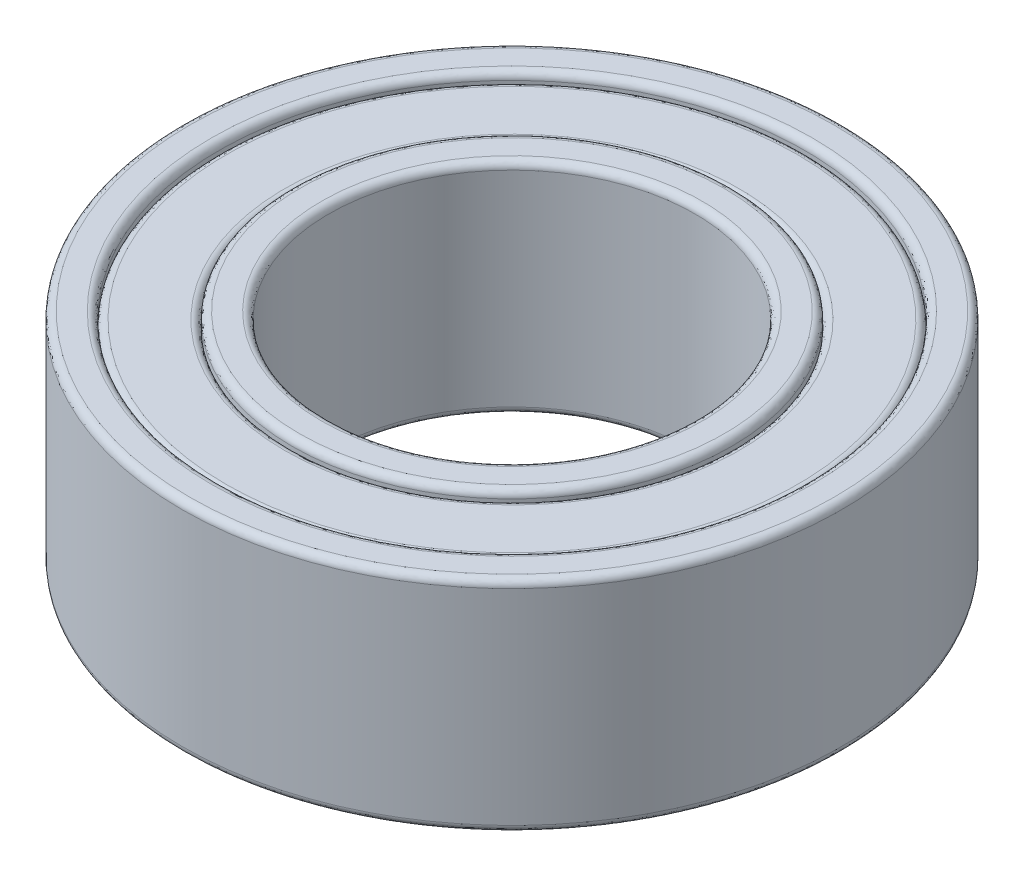
ISO-10303-21;
HEADER;
FILE_DESCRIPTION(('STEP AP214'),'2;1');
FILE_NAME('part.step','',(''),(''),'','','');
FILE_SCHEMA(('AUTOMOTIVE_DESIGN { 1 0 10303 214 1 1 1 1 }'));
ENDSEC;
DATA;
#1=APPLICATION_CONTEXT('core data for automotive mechanical design processes');
#2=APPLICATION_PROTOCOL_DEFINITION('international standard','automotive_design',2000,#1);
#3=PRODUCT_CONTEXT('',#1,'mechanical');
#4=PRODUCT('Part','Part','',(#3));
#5=PRODUCT_RELATED_PRODUCT_CATEGORY('part','',(#4));
#6=PRODUCT_DEFINITION_FORMATION('','',#4);
#7=PRODUCT_DEFINITION_CONTEXT('part definition',#1,'design');
#8=PRODUCT_DEFINITION('design','',#6,#7);
#9=PRODUCT_DEFINITION_SHAPE('','',#8);
#10=(LENGTH_UNIT() NAMED_UNIT(*) SI_UNIT(.MILLI.,.METRE.));
#11=(NAMED_UNIT(*) PLANE_ANGLE_UNIT() SI_UNIT($,.RADIAN.));
#12=(NAMED_UNIT(*) SI_UNIT($,.STERADIAN.) SOLID_ANGLE_UNIT());
#13=UNCERTAINTY_MEASURE_WITH_UNIT(LENGTH_MEASURE(1.E-05),#10,'distance_accuracy_value','');
#14=(GEOMETRIC_REPRESENTATION_CONTEXT(3) GLOBAL_UNCERTAINTY_ASSIGNED_CONTEXT((#13)) GLOBAL_UNIT_ASSIGNED_CONTEXT((#10,
#11,#12)) REPRESENTATION_CONTEXT('',''));
#15=CARTESIAN_POINT('',(0.,0.,0.));
#16=DIRECTION('',(0.,0.,1.));
#17=DIRECTION('',(1.,0.,0.));
#18=AXIS2_PLACEMENT_3D('',#15,#16,#17);
#19=CARTESIAN_POINT('',(0.,2.9,0.));
#20=DIRECTION('',(0.,-1.,0.));
#21=DIRECTION('',(0.,0.,1.));
#22=AXIS2_PLACEMENT_3D('',#19,#20,#21);
#23=CYLINDRICAL_SURFACE('',#22,3.);
#24=DIRECTION('',(0.,-1.,0.));
#25=VECTOR('',#24,1.);
#26=CARTESIAN_POINT('',(0.,2.9,3.));
#27=LINE('',#26,#25);
#28=CARTESIAN_POINT('',(0.,2.9,3.));
#29=VERTEX_POINT('',#28);
#30=CARTESIAN_POINT('',(0.,2.8,3.));
#31=VERTEX_POINT('',#30);
#32=EDGE_CURVE('E11',#29,#31,#27,.T.);
#33=ORIENTED_EDGE('',*,*,#32,.T.);
#34=CARTESIAN_POINT('',(0.,2.8,0.));
#35=DIRECTION('',(0.,1.,0.));
#36=DIRECTION('',(0.,0.,1.));
#37=AXIS2_PLACEMENT_3D('',#34,#35,#36);
#38=CIRCLE('',#37,3.);
#39=EDGE_CURVE('E28',#31,#31,#38,.T.);
#40=ORIENTED_EDGE('',*,*,#39,.T.);
#41=ORIENTED_EDGE('',*,*,#32,.F.);
#42=CARTESIAN_POINT('',(0.,2.9,0.));
#43=DIRECTION('',(0.,1.,0.));
#44=DIRECTION('',(0.,0.,1.));
#45=AXIS2_PLACEMENT_3D('',#42,#43,#44);
#46=CIRCLE('',#45,3.);
#47=EDGE_CURVE('E145',#29,#29,#46,.T.);
#48=ORIENTED_EDGE('',*,*,#47,.F.);
#49=EDGE_LOOP('',(#33,#40,#41,#48));
#50=FACE_BOUND('',#49,.T.);
#51=ADVANCED_FACE('F16',(#50),#23,.T.);
#52=CARTESIAN_POINT('',(0.,2.8,3.));
#53=CARTESIAN_POINT('',(0.,2.85857864376269,3.));
#54=CARTESIAN_POINT('',(0.,2.9,3.04142135623731));
#55=CARTESIAN_POINT('',(0.,2.9,3.1));
#56=(BOUNDED_CURVE() B_SPLINE_CURVE(3,(#52,#53,#54,#55),.UNSPECIFIED.,.F.,
.F.) B_SPLINE_CURVE_WITH_KNOTS((4,4),(0.,1.),
.UNSPECIFIED.) CURVE() GEOMETRIC_REPRESENTATION_ITEM() RATIONAL_B_SPLINE_CURVE((1.,
0.804737854124365,0.804737854124365,1.)) REPRESENTATION_ITEM(''));
#57=CARTESIAN_POINT('',(0.,0.,0.));
#58=DIRECTION('',(0.,-1.,0.));
#59=AXIS1_PLACEMENT('',#57,#58);
#60=SURFACE_OF_REVOLUTION('',#56,#59);
#61=CARTESIAN_POINT('',(0.,2.8,3.1));
#62=DIRECTION('',(1.,0.,0.));
#63=DIRECTION('',(0.,1.,0.));
#64=AXIS2_PLACEMENT_3D('',#61,#62,#63);
#65=CIRCLE('',#64,0.1);
#66=CARTESIAN_POINT('',(0.,2.9,3.1));
#67=VERTEX_POINT('',#66);
#68=EDGE_CURVE('E48',#31,#67,#65,.T.);
#69=ORIENTED_EDGE('',*,*,#68,.T.);
#70=CARTESIAN_POINT('',(0.,2.9,0.));
#71=DIRECTION('',(0.,1.,0.));
#72=DIRECTION('',(0.,0.,1.));
#73=AXIS2_PLACEMENT_3D('',#70,#71,#72);
#74=CIRCLE('',#73,3.1);
#75=EDGE_CURVE('E161',#67,#67,#74,.T.);
#76=ORIENTED_EDGE('',*,*,#75,.T.);
#77=ORIENTED_EDGE('',*,*,#68,.F.);
#78=ORIENTED_EDGE('',*,*,#39,.F.);
#79=EDGE_LOOP('',(#69,#76,#77,#78));
#80=FACE_BOUND('',#79,.T.);
#81=ADVANCED_FACE('F286',(#80),#60,.T.);
#82=CARTESIAN_POINT('',(0.,2.9,0.));
#83=DIRECTION('',(0.,-1.,0.));
#84=DIRECTION('',(-1.,0.,0.));
#85=AXIS2_PLACEMENT_3D('',#82,#83,#84);
#86=PLANE('',#85);
#87=CARTESIAN_POINT('',(0.,2.9,0.));
#88=DIRECTION('',(0.,1.,0.));
#89=DIRECTION('',(0.,0.,1.));
#90=AXIS2_PLACEMENT_3D('',#87,#88,#89);
#91=CIRCLE('',#90,3.9);
#92=CARTESIAN_POINT('',(0.,2.9,3.9));
#93=VERTEX_POINT('',#92);
#94=EDGE_CURVE('E164',#93,#93,#91,.T.);
#95=ORIENTED_EDGE('',*,*,#94,.T.);
#96=EDGE_LOOP('',(#95));
#97=FACE_BOUND('',#96,.T.);
#98=ORIENTED_EDGE('',*,*,#75,.F.);
#99=EDGE_LOOP('',(#98));
#100=FACE_BOUND('',#99,.T.);
#101=ADVANCED_FACE('F290',(#97,#100),#86,.F.);
#102=CARTESIAN_POINT('',(0.,2.9,3.9));
#103=CARTESIAN_POINT('',(0.,2.9,3.95857862527601));
#104=CARTESIAN_POINT('',(0.,2.85857866507801,3.99999997668453));
#105=CARTESIAN_POINT('',(0.,2.800000039802,4.));
#106=(BOUNDED_CURVE() B_SPLINE_CURVE(3,(#102,#103,#104,#105),.UNSPECIFIED.,.F.,
.F.) B_SPLINE_CURVE_WITH_KNOTS((4,4),(0.,1.),
.UNSPECIFIED.) CURVE() GEOMETRIC_REPRESENTATION_ITEM() RATIONAL_B_SPLINE_CURVE((1.,
0.80473794793857,0.80473794793857,1.)) REPRESENTATION_ITEM(''));
#107=CARTESIAN_POINT('',(0.,0.,0.));
#108=DIRECTION('',(0.,-1.,0.));
#109=AXIS1_PLACEMENT('',#107,#108);
#110=SURFACE_OF_REVOLUTION('',#106,#109);
#111=CARTESIAN_POINT('',(0.,2.8,3.9));
#112=DIRECTION('',(1.,0.,0.));
#113=DIRECTION('',(0.,1.,0.));
#114=AXIS2_PLACEMENT_3D('',#111,#112,#113);
#115=CIRCLE('',#114,0.1);
#116=CARTESIAN_POINT('',(0.,2.800000039802,4.));
#117=VERTEX_POINT('',#116);
#118=EDGE_CURVE('E265',#93,#117,#115,.T.);
#119=ORIENTED_EDGE('',*,*,#118,.T.);
#120=CARTESIAN_POINT('',(0.,2.800000039802,0.));
#121=DIRECTION('',(0.,1.,0.));
#122=DIRECTION('',(0.,0.,1.));
#123=AXIS2_PLACEMENT_3D('',#120,#121,#122);
#124=CIRCLE('',#123,4.);
#125=EDGE_CURVE('E261',#117,#117,#124,.T.);
#126=ORIENTED_EDGE('',*,*,#125,.T.);
#127=ORIENTED_EDGE('',*,*,#118,.F.);
#128=ORIENTED_EDGE('',*,*,#94,.F.);
#129=EDGE_LOOP('',(#119,#126,#127,#128));
#130=FACE_BOUND('',#129,.T.);
#131=ADVANCED_FACE('F292',(#130),#110,.T.);
#132=CARTESIAN_POINT('',(0.,2.9,0.));
#133=DIRECTION('',(0.,-1.,0.));
#134=DIRECTION('',(0.,0.,1.));
#135=AXIS2_PLACEMENT_3D('',#132,#133,#134);
#136=CYLINDRICAL_SURFACE('',#135,4.);
#137=CARTESIAN_POINT('',(0.,2.9,0.));
#138=DIRECTION('',(0.,1.,0.));
#139=DIRECTION('',(0.,0.,1.));
#140=AXIS2_PLACEMENT_3D('',#137,#138,#139);
#141=CIRCLE('',#140,4.);
#142=CARTESIAN_POINT('',(0.,2.9,4.));
#143=VERTEX_POINT('',#142);
#144=EDGE_CURVE('E253',#143,#143,#141,.T.);
#145=ORIENTED_EDGE('',*,*,#144,.T.);
#146=DIRECTION('',(0.,-1.,0.));
#147=VECTOR('',#146,1.);
#148=CARTESIAN_POINT('',(0.,2.9,4.));
#149=LINE('',#148,#147);
#150=EDGE_CURVE('E257',#143,#117,#149,.T.);
#151=ORIENTED_EDGE('',*,*,#150,.T.);
#152=ORIENTED_EDGE('',*,*,#125,.F.);
#153=ORIENTED_EDGE('',*,*,#150,.F.);
#154=EDGE_LOOP('',(#145,#151,#152,#153));
#155=FACE_BOUND('',#154,.T.);
#156=ADVANCED_FACE('F295',(#155),#136,.F.);
#157=CARTESIAN_POINT('',(0.,2.9,4.));
#158=CARTESIAN_POINT('',(0.,2.95857864376269,4.));
#159=CARTESIAN_POINT('',(0.,3.,4.04142135623731));
#160=CARTESIAN_POINT('',(0.,3.,4.1));
#161=(BOUNDED_CURVE() B_SPLINE_CURVE(3,(#157,#158,#159,#160),.UNSPECIFIED.,.F.,
.F.) B_SPLINE_CURVE_WITH_KNOTS((4,4),(0.,1.),
.UNSPECIFIED.) CURVE() GEOMETRIC_REPRESENTATION_ITEM() RATIONAL_B_SPLINE_CURVE((1.,
0.804737854124365,0.804737854124365,1.)) REPRESENTATION_ITEM(''));
#162=CARTESIAN_POINT('',(0.,0.,0.));
#163=DIRECTION('',(0.,-1.,0.));
#164=AXIS1_PLACEMENT('',#162,#163);
#165=SURFACE_OF_REVOLUTION('',#161,#164);
#166=CARTESIAN_POINT('',(0.,2.9,4.1));
#167=DIRECTION('',(1.,0.,0.));
#168=DIRECTION('',(0.,1.,0.));
#169=AXIS2_PLACEMENT_3D('',#166,#167,#168);
#170=CIRCLE('',#169,0.1);
#171=CARTESIAN_POINT('',(0.,3.,4.1));
#172=VERTEX_POINT('',#171);
#173=EDGE_CURVE('E250',#143,#172,#170,.T.);
#174=ORIENTED_EDGE('',*,*,#173,.T.);
#175=CARTESIAN_POINT('',(0.,3.,0.));
#176=DIRECTION('',(0.,1.,0.));
#177=DIRECTION('',(0.,0.,1.));
#178=AXIS2_PLACEMENT_3D('',#175,#176,#177);
#179=CIRCLE('',#178,4.1);
#180=EDGE_CURVE('E229',#172,#172,#179,.T.);
#181=ORIENTED_EDGE('',*,*,#180,.T.);
#182=ORIENTED_EDGE('',*,*,#173,.F.);
#183=ORIENTED_EDGE('',*,*,#144,.F.);
#184=EDGE_LOOP('',(#174,#181,#182,#183));
#185=FACE_BOUND('',#184,.T.);
#186=ADVANCED_FACE('F297',(#185),#165,.T.);
#187=CARTESIAN_POINT('',(0.,3.,0.));
#188=DIRECTION('',(0.,1.,0.));
#189=DIRECTION('',(0.,0.,-1.));
#190=AXIS2_PLACEMENT_3D('',#187,#188,#189);
#191=PLANE('',#190);
#192=ORIENTED_EDGE('',*,*,#180,.F.);
#193=EDGE_LOOP('',(#192));
#194=FACE_BOUND('',#193,.T.);
#195=CARTESIAN_POINT('',(0.,3.,0.));
#196=DIRECTION('',(0.,1.,0.));
#197=DIRECTION('',(0.,0.,1.));
#198=AXIS2_PLACEMENT_3D('',#195,#196,#197);
#199=CIRCLE('',#198,4.4);
#200=CARTESIAN_POINT('',(0.,3.,4.4));
#201=VERTEX_POINT('',#200);
#202=EDGE_CURVE('E226',#201,#201,#199,.T.);
#203=ORIENTED_EDGE('',*,*,#202,.T.);
#204=EDGE_LOOP('',(#203));
#205=FACE_BOUND('',#204,.T.);
#206=ADVANCED_FACE('F300',(#194,#205),#191,.T.);
#207=CARTESIAN_POINT('',(0.,3.,4.4));
#208=CARTESIAN_POINT('',(0.,3.,4.45857864376269));
#209=CARTESIAN_POINT('',(0.,2.95857864376269,4.5));
#210=CARTESIAN_POINT('',(0.,2.9,4.5));
#211=(BOUNDED_CURVE() B_SPLINE_CURVE(3,(#207,#208,#209,#210),.UNSPECIFIED.,.F.,
.F.) B_SPLINE_CURVE_WITH_KNOTS((4,4),(0.,1.),
.UNSPECIFIED.) CURVE() GEOMETRIC_REPRESENTATION_ITEM() RATIONAL_B_SPLINE_CURVE((1.,
0.804737854124365,0.804737854124365,1.)) REPRESENTATION_ITEM(''));
#212=CARTESIAN_POINT('',(0.,0.,0.));
#213=DIRECTION('',(0.,-1.,0.));
#214=AXIS1_PLACEMENT('',#212,#213);
#215=SURFACE_OF_REVOLUTION('',#211,#214);
#216=CARTESIAN_POINT('',(0.,2.9,4.4));
#217=DIRECTION('',(1.,0.,0.));
#218=DIRECTION('',(0.,1.,0.));
#219=AXIS2_PLACEMENT_3D('',#216,#217,#218);
#220=CIRCLE('',#219,0.1);
#221=CARTESIAN_POINT('',(0.,2.9,4.5));
#222=VERTEX_POINT('',#221);
#223=EDGE_CURVE('E230',#201,#222,#220,.T.);
#224=ORIENTED_EDGE('',*,*,#223,.T.);
#225=CARTESIAN_POINT('',(0.,2.9,0.));
#226=DIRECTION('',(0.,1.,0.));
#227=DIRECTION('',(0.,0.,1.));
#228=AXIS2_PLACEMENT_3D('',#225,#226,#227);
#229=CIRCLE('',#228,4.5);
#230=EDGE_CURVE('E241',#222,#222,#229,.T.);
#231=ORIENTED_EDGE('',*,*,#230,.T.);
#232=ORIENTED_EDGE('',*,*,#223,.F.);
#233=ORIENTED_EDGE('',*,*,#202,.F.);
#234=EDGE_LOOP('',(#224,#231,#232,#233));
#235=FACE_BOUND('',#234,.T.);
#236=ADVANCED_FACE('F302',(#235),#215,.T.);
#237=CARTESIAN_POINT('',(0.,0.1,0.));
#238=DIRECTION('',(0.,1.,0.));
#239=DIRECTION('',(0.,0.,1.));
#240=AXIS2_PLACEMENT_3D('',#237,#238,#239);
#241=CYLINDRICAL_SURFACE('',#240,4.5);
#242=CARTESIAN_POINT('',(0.,0.1,0.));
#243=DIRECTION('',(0.,1.,0.));
#244=DIRECTION('',(0.,0.,1.));
#245=AXIS2_PLACEMENT_3D('',#242,#243,#244);
#246=CIRCLE('',#245,4.5);
#247=CARTESIAN_POINT('',(0.,0.1,4.5));
#248=VERTEX_POINT('',#247);
#249=EDGE_CURVE('E233',#248,#248,#246,.T.);
#250=ORIENTED_EDGE('',*,*,#249,.T.);
#251=DIRECTION('',(0.,1.,0.));
#252=VECTOR('',#251,1.);
#253=CARTESIAN_POINT('',(0.,0.1,4.5));
#254=LINE('',#253,#252);
#255=EDGE_CURVE('E237',#248,#222,#254,.T.);
#256=ORIENTED_EDGE('',*,*,#255,.T.);
#257=ORIENTED_EDGE('',*,*,#230,.F.);
#258=ORIENTED_EDGE('',*,*,#255,.F.);
#259=EDGE_LOOP('',(#250,#256,#257,#258));
#260=FACE_BOUND('',#259,.T.);
#261=ADVANCED_FACE('F333',(#260),#241,.T.);
#262=CARTESIAN_POINT('',(0.,0.1,4.5));
#263=CARTESIAN_POINT('',(0.,0.0414213562373095,4.5));
#264=CARTESIAN_POINT('',(0.,0.,4.45857864376269));
#265=CARTESIAN_POINT('',(0.,0.,4.4));
#266=(BOUNDED_CURVE() B_SPLINE_CURVE(3,(#262,#263,#264,#265),.UNSPECIFIED.,.F.,
.F.) B_SPLINE_CURVE_WITH_KNOTS((4,4),(0.,1.),
.UNSPECIFIED.) CURVE() GEOMETRIC_REPRESENTATION_ITEM() RATIONAL_B_SPLINE_CURVE((1.,
0.804737854124365,0.804737854124365,1.)) REPRESENTATION_ITEM(''));
#267=CARTESIAN_POINT('',(0.,0.,0.));
#268=DIRECTION('',(0.,-1.,0.));
#269=AXIS1_PLACEMENT('',#267,#268);
#270=SURFACE_OF_REVOLUTION('',#266,#269);
#271=CARTESIAN_POINT('',(0.,0.1,4.4));
#272=DIRECTION('',(1.,0.,0.));
#273=DIRECTION('',(0.,1.,0.));
#274=AXIS2_PLACEMENT_3D('',#271,#272,#273);
#275=CIRCLE('',#274,0.1);
#276=CARTESIAN_POINT('',(0.,0.,4.4));
#277=VERTEX_POINT('',#276);
#278=EDGE_CURVE('E225',#248,#277,#275,.T.);
#279=ORIENTED_EDGE('',*,*,#278,.T.);
#280=CARTESIAN_POINT('',(0.,0.,0.));
#281=DIRECTION('',(0.,1.,0.));
#282=DIRECTION('',(0.,0.,1.));
#283=AXIS2_PLACEMENT_3D('',#280,#281,#282);
#284=CIRCLE('',#283,4.4);
#285=EDGE_CURVE('E221',#277,#277,#284,.T.);
#286=ORIENTED_EDGE('',*,*,#285,.T.);
#287=ORIENTED_EDGE('',*,*,#278,.F.);
#288=ORIENTED_EDGE('',*,*,#249,.F.);
#289=EDGE_LOOP('',(#279,#286,#287,#288));
#290=FACE_BOUND('',#289,.T.);
#291=ADVANCED_FACE('F329',(#290),#270,.T.);
#292=CARTESIAN_POINT('',(0.,0.,0.));
#293=DIRECTION('',(0.,-1.,0.));
#294=DIRECTION('',(-1.,0.,0.));
#295=AXIS2_PLACEMENT_3D('',#292,#293,#294);
#296=PLANE('',#295);
#297=ORIENTED_EDGE('',*,*,#285,.F.);
#298=EDGE_LOOP('',(#297));
#299=FACE_BOUND('',#298,.T.);
#300=CARTESIAN_POINT('',(0.,0.,0.));
#301=DIRECTION('',(0.,1.,0.));
#302=DIRECTION('',(0.,0.,1.));
#303=AXIS2_PLACEMENT_3D('',#300,#301,#302);
#304=CIRCLE('',#303,4.1);
#305=CARTESIAN_POINT('',(0.,0.,4.1));
#306=VERTEX_POINT('',#305);
#307=EDGE_CURVE('E218',#306,#306,#304,.T.);
#308=ORIENTED_EDGE('',*,*,#307,.T.);
#309=EDGE_LOOP('',(#308));
#310=FACE_BOUND('',#309,.T.);
#311=ADVANCED_FACE('F332',(#299,#310),#296,.T.);
#312=CARTESIAN_POINT('',(0.,0.,4.1));
#313=CARTESIAN_POINT('',(0.,0.,4.04142135623731));
#314=CARTESIAN_POINT('',(0.,0.0414213562373095,4.));
#315=CARTESIAN_POINT('',(0.,0.1,4.));
#316=(BOUNDED_CURVE() B_SPLINE_CURVE(3,(#312,#313,#314,#315),.UNSPECIFIED.,.F.,
.F.) B_SPLINE_CURVE_WITH_KNOTS((4,4),(0.,1.),
.UNSPECIFIED.) CURVE() GEOMETRIC_REPRESENTATION_ITEM() RATIONAL_B_SPLINE_CURVE((1.,
0.804737854124365,0.804737854124365,1.)) REPRESENTATION_ITEM(''));
#317=CARTESIAN_POINT('',(0.,0.,0.));
#318=DIRECTION('',(0.,-1.,0.));
#319=AXIS1_PLACEMENT('',#317,#318);
#320=SURFACE_OF_REVOLUTION('',#316,#319);
#321=CARTESIAN_POINT('',(0.,0.1,4.1));
#322=DIRECTION('',(1.,0.,0.));
#323=DIRECTION('',(0.,1.,0.));
#324=AXIS2_PLACEMENT_3D('',#321,#322,#323);
#325=CIRCLE('',#324,0.1);
#326=CARTESIAN_POINT('',(0.,0.1,4.));
#327=VERTEX_POINT('',#326);
#328=EDGE_CURVE('E215',#306,#327,#325,.T.);
#329=ORIENTED_EDGE('',*,*,#328,.T.);
#330=CARTESIAN_POINT('',(0.,0.1,0.));
#331=DIRECTION('',(0.,1.,0.));
#332=DIRECTION('',(0.,0.,1.));
#333=AXIS2_PLACEMENT_3D('',#330,#331,#332);
#334=CIRCLE('',#333,4.);
#335=EDGE_CURVE('E211',#327,#327,#334,.T.);
#336=ORIENTED_EDGE('',*,*,#335,.T.);
#337=ORIENTED_EDGE('',*,*,#328,.F.);
#338=ORIENTED_EDGE('',*,*,#307,.F.);
#339=EDGE_LOOP('',(#329,#336,#337,#338));
#340=FACE_BOUND('',#339,.T.);
#341=ADVANCED_FACE('F335',(#340),#320,.T.);
#342=CARTESIAN_POINT('',(0.,0.1,0.));
#343=DIRECTION('',(0.,1.,0.));
#344=DIRECTION('',(0.,0.,1.));
#345=AXIS2_PLACEMENT_3D('',#342,#343,#344);
#346=CYLINDRICAL_SURFACE('',#345,4.);
#347=DIRECTION('',(0.,1.,0.));
#348=VECTOR('',#347,1.);
#349=CARTESIAN_POINT('',(0.,0.1,4.));
#350=LINE('',#349,#348);
#351=CARTESIAN_POINT('',(0.,0.2,4.));
#352=VERTEX_POINT('',#351);
#353=EDGE_CURVE('E208',#327,#352,#350,.T.);
#354=ORIENTED_EDGE('',*,*,#353,.T.);
#355=CARTESIAN_POINT('',(0.,0.2,0.));
#356=DIRECTION('',(0.,1.,0.));
#357=DIRECTION('',(0.,0.,1.));
#358=AXIS2_PLACEMENT_3D('',#355,#356,#357);
#359=CIRCLE('',#358,4.);
#360=EDGE_CURVE('E204',#352,#352,#359,.T.);
#361=ORIENTED_EDGE('',*,*,#360,.T.);
#362=ORIENTED_EDGE('',*,*,#353,.F.);
#363=ORIENTED_EDGE('',*,*,#335,.F.);
#364=EDGE_LOOP('',(#354,#361,#362,#363));
#365=FACE_BOUND('',#364,.T.);
#366=ADVANCED_FACE('F338',(#365),#346,.F.);
#367=CARTESIAN_POINT('',(0.,0.2,4.));
#368=CARTESIAN_POINT('',(0.,0.14142135623731,4.));
#369=CARTESIAN_POINT('',(0.,0.1,3.95857864376269));
#370=CARTESIAN_POINT('',(0.,0.1,3.9));
#371=(BOUNDED_CURVE() B_SPLINE_CURVE(3,(#367,#368,#369,#370),.UNSPECIFIED.,.F.,
.F.) B_SPLINE_CURVE_WITH_KNOTS((4,4),(0.,1.),
.UNSPECIFIED.) CURVE() GEOMETRIC_REPRESENTATION_ITEM() RATIONAL_B_SPLINE_CURVE((1.,
0.804737854124365,0.804737854124365,1.)) REPRESENTATION_ITEM(''));
#372=CARTESIAN_POINT('',(0.,0.,0.));
#373=DIRECTION('',(0.,-1.,0.));
#374=AXIS1_PLACEMENT('',#372,#373);
#375=SURFACE_OF_REVOLUTION('',#371,#374);
#376=CARTESIAN_POINT('',(0.,0.2,3.9));
#377=DIRECTION('',(1.,0.,0.));
#378=DIRECTION('',(0.,1.,0.));
#379=AXIS2_PLACEMENT_3D('',#376,#377,#378);
#380=CIRCLE('',#379,0.1);
#381=CARTESIAN_POINT('',(0.,0.1,3.9));
#382=VERTEX_POINT('',#381);
#383=EDGE_CURVE('E180',#352,#382,#380,.T.);
#384=ORIENTED_EDGE('',*,*,#383,.T.);
#385=CARTESIAN_POINT('',(0.,0.1,0.));
#386=DIRECTION('',(0.,1.,0.));
#387=DIRECTION('',(0.,0.,1.));
#388=AXIS2_PLACEMENT_3D('',#385,#386,#387);
#389=CIRCLE('',#388,3.9);
#390=EDGE_CURVE('E176',#382,#382,#389,.T.);
#391=ORIENTED_EDGE('',*,*,#390,.T.);
#392=ORIENTED_EDGE('',*,*,#383,.F.);
#393=ORIENTED_EDGE('',*,*,#360,.F.);
#394=EDGE_LOOP('',(#384,#391,#392,#393));
#395=FACE_BOUND('',#394,.T.);
#396=ADVANCED_FACE('F340',(#395),#375,.T.);
#397=CARTESIAN_POINT('',(0.,0.1,0.));
#398=DIRECTION('',(0.,1.,0.));
#399=DIRECTION('',(0.,0.,-1.));
#400=AXIS2_PLACEMENT_3D('',#397,#398,#399);
#401=PLANE('',#400);
#402=CARTESIAN_POINT('',(0.,0.1,0.));
#403=DIRECTION('',(0.,1.,0.));
#404=DIRECTION('',(0.,0.,1.));
#405=AXIS2_PLACEMENT_3D('',#402,#403,#404);
#406=CIRCLE('',#405,3.1);
#407=CARTESIAN_POINT('',(0.,0.1,3.1));
#408=VERTEX_POINT('',#407);
#409=EDGE_CURVE('E181',#408,#408,#406,.T.);
#410=ORIENTED_EDGE('',*,*,#409,.T.);
#411=EDGE_LOOP('',(#410));
#412=FACE_BOUND('',#411,.T.);
#413=ORIENTED_EDGE('',*,*,#390,.F.);
#414=EDGE_LOOP('',(#413));
#415=FACE_BOUND('',#414,.T.);
#416=ADVANCED_FACE('F343',(#412,#415),#401,.F.);
#417=CARTESIAN_POINT('',(0.,0.1,3.1));
#418=CARTESIAN_POINT('',(0.,0.1,3.04142135623731));
#419=CARTESIAN_POINT('',(0.,0.14142135623731,3.));
#420=CARTESIAN_POINT('',(0.,0.2,3.));
#421=(BOUNDED_CURVE() B_SPLINE_CURVE(3,(#417,#418,#419,#420),.UNSPECIFIED.,.F.,
.F.) B_SPLINE_CURVE_WITH_KNOTS((4,4),(0.,1.),
.UNSPECIFIED.) CURVE() GEOMETRIC_REPRESENTATION_ITEM() RATIONAL_B_SPLINE_CURVE((1.,
0.804737854124365,0.804737854124365,1.)) REPRESENTATION_ITEM(''));
#422=CARTESIAN_POINT('',(0.,0.,0.));
#423=DIRECTION('',(0.,-1.,0.));
#424=AXIS1_PLACEMENT('',#422,#423);
#425=SURFACE_OF_REVOLUTION('',#421,#424);
#426=CARTESIAN_POINT('',(0.,0.2,3.1));
#427=DIRECTION('',(1.,0.,0.));
#428=DIRECTION('',(0.,1.,0.));
#429=AXIS2_PLACEMENT_3D('',#426,#427,#428);
#430=CIRCLE('',#429,0.1);
#431=CARTESIAN_POINT('',(0.,0.2,3.));
#432=VERTEX_POINT('',#431);
#433=EDGE_CURVE('E197',#408,#432,#430,.T.);
#434=ORIENTED_EDGE('',*,*,#433,.T.);
#435=CARTESIAN_POINT('',(0.,0.2,0.));
#436=DIRECTION('',(0.,1.,0.));
#437=DIRECTION('',(0.,0.,1.));
#438=AXIS2_PLACEMENT_3D('',#435,#436,#437);
#439=CIRCLE('',#438,3.);
#440=EDGE_CURVE('E196',#432,#432,#439,.T.);
#441=ORIENTED_EDGE('',*,*,#440,.T.);
#442=ORIENTED_EDGE('',*,*,#433,.F.);
#443=ORIENTED_EDGE('',*,*,#409,.F.);
#444=EDGE_LOOP('',(#434,#441,#442,#443));
#445=FACE_BOUND('',#444,.T.);
#446=ADVANCED_FACE('F345',(#445),#425,.T.);
#447=CARTESIAN_POINT('',(0.,0.1,0.));
#448=DIRECTION('',(0.,1.,0.));
#449=DIRECTION('',(0.,0.,1.));
#450=AXIS2_PLACEMENT_3D('',#447,#448,#449);
#451=CYLINDRICAL_SURFACE('',#450,3.);
#452=CARTESIAN_POINT('',(0.,0.1,0.));
#453=DIRECTION('',(0.,1.,0.));
#454=DIRECTION('',(0.,0.,1.));
#455=AXIS2_PLACEMENT_3D('',#452,#453,#454);
#456=CIRCLE('',#455,3.);
#457=CARTESIAN_POINT('',(0.,0.1,3.));
#458=VERTEX_POINT('',#457);
#459=EDGE_CURVE('E191',#458,#458,#456,.T.);
#460=ORIENTED_EDGE('',*,*,#459,.T.);
#461=DIRECTION('',(0.,1.,0.));
#462=VECTOR('',#461,1.);
#463=CARTESIAN_POINT('',(0.,0.1,3.));
#464=LINE('',#463,#462);
#465=EDGE_CURVE('E192',#458,#432,#464,.T.);
#466=ORIENTED_EDGE('',*,*,#465,.T.);
#467=ORIENTED_EDGE('',*,*,#440,.F.);
#468=ORIENTED_EDGE('',*,*,#465,.F.);
#469=EDGE_LOOP('',(#460,#466,#467,#468));
#470=FACE_BOUND('',#469,.T.);
#471=ADVANCED_FACE('F375',(#470),#451,.T.);
#472=CARTESIAN_POINT('',(0.,0.1,3.));
#473=CARTESIAN_POINT('',(0.,0.0414213562373095,3.));
#474=CARTESIAN_POINT('',(0.,0.,2.95857864376269));
#475=CARTESIAN_POINT('',(0.,0.,2.9));
#476=(BOUNDED_CURVE() B_SPLINE_CURVE(3,(#472,#473,#474,#475),.UNSPECIFIED.,.F.,
.F.) B_SPLINE_CURVE_WITH_KNOTS((4,4),(0.,1.),
.UNSPECIFIED.) CURVE() GEOMETRIC_REPRESENTATION_ITEM() RATIONAL_B_SPLINE_CURVE((1.,
0.804737854124365,0.804737854124365,1.)) REPRESENTATION_ITEM(''));
#477=CARTESIAN_POINT('',(0.,0.,0.));
#478=DIRECTION('',(0.,-1.,0.));
#479=AXIS1_PLACEMENT('',#477,#478);
#480=SURFACE_OF_REVOLUTION('',#476,#479);
#481=CARTESIAN_POINT('',(0.,0.1,2.9));
#482=DIRECTION('',(1.,0.,0.));
#483=DIRECTION('',(0.,1.,0.));
#484=AXIS2_PLACEMENT_3D('',#481,#482,#483);
#485=CIRCLE('',#484,0.1);
#486=CARTESIAN_POINT('',(0.,0.,2.9));
#487=VERTEX_POINT('',#486);
#488=EDGE_CURVE('E188',#458,#487,#485,.T.);
#489=ORIENTED_EDGE('',*,*,#488,.T.);
#490=CARTESIAN_POINT('',(0.,0.,0.));
#491=DIRECTION('',(0.,1.,0.));
#492=DIRECTION('',(0.,0.,1.));
#493=AXIS2_PLACEMENT_3D('',#490,#491,#492);
#494=CIRCLE('',#493,2.9);
#495=EDGE_CURVE('E159',#487,#487,#494,.T.);
#496=ORIENTED_EDGE('',*,*,#495,.T.);
#497=ORIENTED_EDGE('',*,*,#488,.F.);
#498=ORIENTED_EDGE('',*,*,#459,.F.);
#499=EDGE_LOOP('',(#489,#496,#497,#498));
#500=FACE_BOUND('',#499,.T.);
#501=ADVANCED_FACE('F371',(#500),#480,.T.);
#502=CARTESIAN_POINT('',(0.,0.,0.));
#503=DIRECTION('',(0.,-1.,0.));
#504=DIRECTION('',(-1.,0.,0.));
#505=AXIS2_PLACEMENT_3D('',#502,#503,#504);
#506=PLANE('',#505);
#507=ORIENTED_EDGE('',*,*,#495,.F.);
#508=EDGE_LOOP('',(#507));
#509=FACE_BOUND('',#508,.T.);
#510=CARTESIAN_POINT('',(0.,0.,0.));
#511=DIRECTION('',(0.,1.,0.));
#512=DIRECTION('',(0.,0.,1.));
#513=AXIS2_PLACEMENT_3D('',#510,#511,#512);
#514=CIRCLE('',#513,2.6);
#515=CARTESIAN_POINT('',(0.,0.,2.6));
#516=VERTEX_POINT('',#515);
#517=EDGE_CURVE('E185',#516,#516,#514,.T.);
#518=ORIENTED_EDGE('',*,*,#517,.T.);
#519=EDGE_LOOP('',(#518));
#520=FACE_BOUND('',#519,.T.);
#521=ADVANCED_FACE('F374',(#509,#520),#506,.T.);
#522=CARTESIAN_POINT('',(0.,0.,2.6));
#523=CARTESIAN_POINT('',(0.,0.,2.54142135623731));
#524=CARTESIAN_POINT('',(0.,0.0414213562373095,2.5));
#525=CARTESIAN_POINT('',(0.,0.1,2.5));
#526=(BOUNDED_CURVE() B_SPLINE_CURVE(3,(#522,#523,#524,#525),.UNSPECIFIED.,.F.,
.F.) B_SPLINE_CURVE_WITH_KNOTS((4,4),(0.,1.),
.UNSPECIFIED.) CURVE() GEOMETRIC_REPRESENTATION_ITEM() RATIONAL_B_SPLINE_CURVE((1.,
0.804737854124365,0.804737854124365,1.)) REPRESENTATION_ITEM(''));
#527=CARTESIAN_POINT('',(0.,0.,0.));
#528=DIRECTION('',(0.,-1.,0.));
#529=AXIS1_PLACEMENT('',#527,#528);
#530=SURFACE_OF_REVOLUTION('',#526,#529);
#531=CARTESIAN_POINT('',(0.,0.1,2.6));
#532=DIRECTION('',(1.,0.,0.));
#533=DIRECTION('',(0.,1.,0.));
#534=AXIS2_PLACEMENT_3D('',#531,#532,#533);
#535=CIRCLE('',#534,0.1);
#536=CARTESIAN_POINT('',(0.,0.1,2.5));
#537=VERTEX_POINT('',#536);
#538=EDGE_CURVE('E182',#516,#537,#535,.T.);
#539=ORIENTED_EDGE('',*,*,#538,.T.);
#540=CARTESIAN_POINT('',(0.,0.1,0.));
#541=DIRECTION('',(0.,1.,0.));
#542=DIRECTION('',(0.,0.,1.));
#543=AXIS2_PLACEMENT_3D('',#540,#541,#542);
#544=CIRCLE('',#543,2.5);
#545=EDGE_CURVE('E175',#537,#537,#544,.T.);
#546=ORIENTED_EDGE('',*,*,#545,.T.);
#547=ORIENTED_EDGE('',*,*,#538,.F.);
#548=ORIENTED_EDGE('',*,*,#517,.F.);
#549=EDGE_LOOP('',(#539,#546,#547,#548));
#550=FACE_BOUND('',#549,.T.);
#551=ADVANCED_FACE('F377',(#550),#530,.T.);
#552=CARTESIAN_POINT('',(0.,2.9,0.));
#553=DIRECTION('',(0.,-1.,0.));
#554=DIRECTION('',(0.,0.,1.));
#555=AXIS2_PLACEMENT_3D('',#552,#553,#554);
#556=CYLINDRICAL_SURFACE('',#555,2.5);
#557=CARTESIAN_POINT('',(0.,2.9,0.));
#558=DIRECTION('',(0.,1.,0.));
#559=DIRECTION('',(0.,0.,1.));
#560=AXIS2_PLACEMENT_3D('',#557,#558,#559);
#561=CIRCLE('',#560,2.5);
#562=CARTESIAN_POINT('',(0.,2.9,2.5));
#563=VERTEX_POINT('',#562);
#564=EDGE_CURVE('E167',#563,#563,#561,.T.);
#565=ORIENTED_EDGE('',*,*,#564,.T.);
#566=DIRECTION('',(0.,-1.,0.));
#567=VECTOR('',#566,1.);
#568=CARTESIAN_POINT('',(0.,2.9,2.5));
#569=LINE('',#568,#567);
#570=EDGE_CURVE('E171',#563,#537,#569,.T.);
#571=ORIENTED_EDGE('',*,*,#570,.T.);
#572=ORIENTED_EDGE('',*,*,#545,.F.);
#573=ORIENTED_EDGE('',*,*,#570,.F.);
#574=EDGE_LOOP('',(#565,#571,#572,#573));
#575=FACE_BOUND('',#574,.T.);
#576=ADVANCED_FACE('F379',(#575),#556,.F.);
#577=CARTESIAN_POINT('',(0.,2.9,2.5));
#578=CARTESIAN_POINT('',(0.,2.95857864376269,2.5));
#579=CARTESIAN_POINT('',(0.,3.,2.54142135623731));
#580=CARTESIAN_POINT('',(0.,3.,2.6));
#581=(BOUNDED_CURVE() B_SPLINE_CURVE(3,(#577,#578,#579,#580),.UNSPECIFIED.,.F.,
.F.) B_SPLINE_CURVE_WITH_KNOTS((4,4),(0.,1.),
.UNSPECIFIED.) CURVE() GEOMETRIC_REPRESENTATION_ITEM() RATIONAL_B_SPLINE_CURVE((1.,
0.804737854124365,0.804737854124365,1.)) REPRESENTATION_ITEM(''));
#582=CARTESIAN_POINT('',(0.,0.,0.));
#583=DIRECTION('',(0.,-1.,0.));
#584=AXIS1_PLACEMENT('',#582,#583);
#585=SURFACE_OF_REVOLUTION('',#581,#584);
#586=CARTESIAN_POINT('',(0.,2.9,2.6));
#587=DIRECTION('',(1.,0.,0.));
#588=DIRECTION('',(0.,1.,0.));
#589=AXIS2_PLACEMENT_3D('',#586,#587,#588);
#590=CIRCLE('',#589,0.1);
#591=CARTESIAN_POINT('',(0.,3.,2.6));
#592=VERTEX_POINT('',#591);
#593=EDGE_CURVE('E153',#563,#592,#590,.T.);
#594=ORIENTED_EDGE('',*,*,#593,.T.);
#595=CARTESIAN_POINT('',(0.,3.,0.));
#596=DIRECTION('',(0.,1.,0.));
#597=DIRECTION('',(0.,0.,1.));
#598=AXIS2_PLACEMENT_3D('',#595,#596,#597);
#599=CIRCLE('',#598,2.6);
#600=EDGE_CURVE('E144',#592,#592,#599,.T.);
#601=ORIENTED_EDGE('',*,*,#600,.T.);
#602=ORIENTED_EDGE('',*,*,#593,.F.);
#603=ORIENTED_EDGE('',*,*,#564,.F.);
#604=EDGE_LOOP('',(#594,#601,#602,#603));
#605=FACE_BOUND('',#604,.T.);
#606=ADVANCED_FACE('F381',(#605),#585,.T.);
#607=CARTESIAN_POINT('',(0.,3.,0.));
#608=DIRECTION('',(0.,1.,0.));
#609=DIRECTION('',(0.,0.,-1.));
#610=AXIS2_PLACEMENT_3D('',#607,#608,#609);
#611=PLANE('',#610);
#612=ORIENTED_EDGE('',*,*,#600,.F.);
#613=EDGE_LOOP('',(#612));
#614=FACE_BOUND('',#613,.T.);
#615=CARTESIAN_POINT('',(0.,3.,0.));
#616=DIRECTION('',(0.,1.,0.));
#617=DIRECTION('',(0.,0.,1.));
#618=AXIS2_PLACEMENT_3D('',#615,#616,#617);
#619=CIRCLE('',#618,2.9);
#620=CARTESIAN_POINT('',(0.,3.,2.9));
#621=VERTEX_POINT('',#620);
#622=EDGE_CURVE('E138',#621,#621,#619,.T.);
#623=ORIENTED_EDGE('',*,*,#622,.T.);
#624=EDGE_LOOP('',(#623));
#625=FACE_BOUND('',#624,.T.);
#626=ADVANCED_FACE('F139',(#614,#625),#611,.T.);
#627=CARTESIAN_POINT('',(0.,3.,2.9));
#628=CARTESIAN_POINT('',(0.,3.,2.95857864376269));
#629=CARTESIAN_POINT('',(0.,2.95857864376269,3.));
#630=CARTESIAN_POINT('',(0.,2.9,3.));
#631=(BOUNDED_CURVE() B_SPLINE_CURVE(3,(#627,#628,#629,#630),.UNSPECIFIED.,.F.,
.F.) B_SPLINE_CURVE_WITH_KNOTS((4,4),(0.,1.),
.UNSPECIFIED.) CURVE() GEOMETRIC_REPRESENTATION_ITEM() RATIONAL_B_SPLINE_CURVE((1.,
0.804737854124365,0.804737854124365,1.)) REPRESENTATION_ITEM(''));
#632=CARTESIAN_POINT('',(0.,0.,0.));
#633=DIRECTION('',(0.,-1.,0.));
#634=AXIS1_PLACEMENT('',#632,#633);
#635=SURFACE_OF_REVOLUTION('',#631,#634);
#636=CARTESIAN_POINT('',(0.,2.9,2.9));
#637=DIRECTION('',(1.,0.,0.));
#638=DIRECTION('',(0.,1.,0.));
#639=AXIS2_PLACEMENT_3D('',#636,#637,#638);
#640=CIRCLE('',#639,0.1);
#641=EDGE_CURVE('E156',#621,#29,#640,.T.);
#642=ORIENTED_EDGE('',*,*,#641,.T.);
#643=ORIENTED_EDGE('',*,*,#47,.T.);
#644=ORIENTED_EDGE('',*,*,#641,.F.);
#645=ORIENTED_EDGE('',*,*,#622,.F.);
#646=EDGE_LOOP('',(#642,#643,#644,#645));
#647=FACE_BOUND('',#646,.T.);
#648=ADVANCED_FACE('F18',(#647),#635,.T.);
#649=CLOSED_SHELL('',(#51,#81,#101,#131,#156,#186,#206,#236,#261,#291,#311,#341,#366,#396,#416,
#446,#471,#501,#521,#551,#576,#606,#626,#648));
#650=MANIFOLD_SOLID_BREP('B1',#649);
#651=ADVANCED_BREP_SHAPE_REPRESENTATION('',(#18,#650),#14);
#652=SHAPE_DEFINITION_REPRESENTATION(#9,#651);
ENDSEC;
END-ISO-10303-21;
